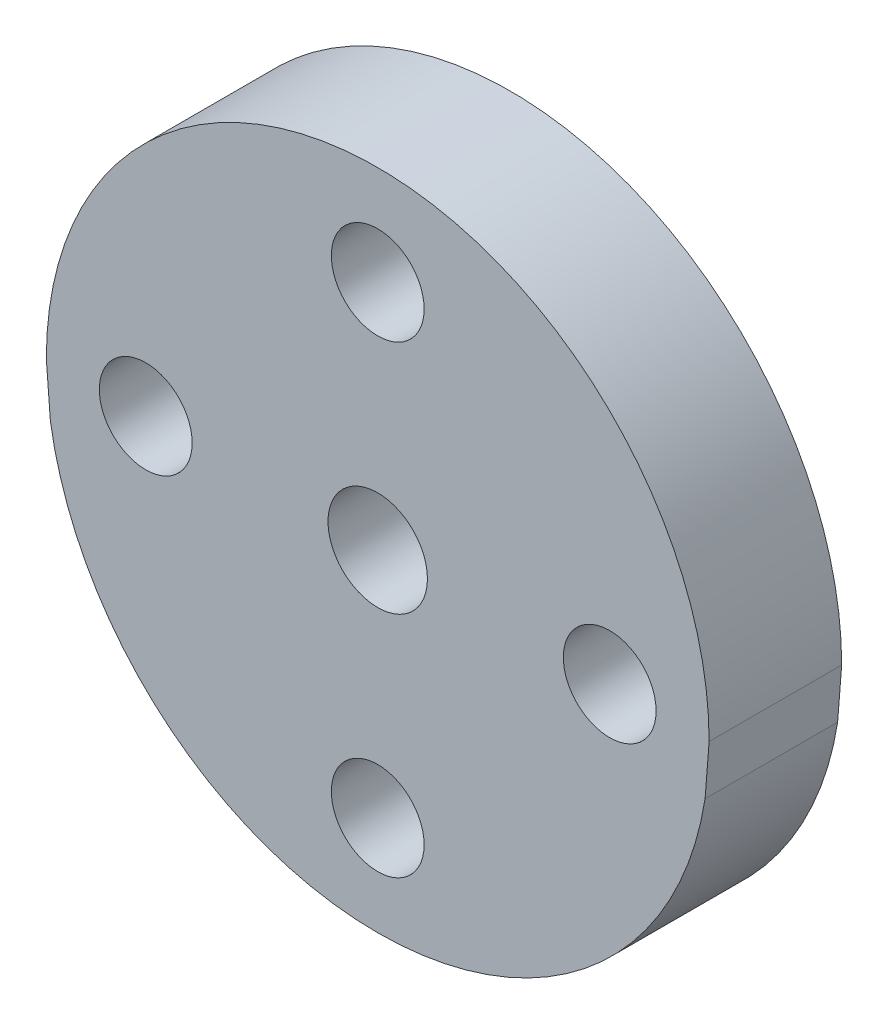
ISO-10303-21;
HEADER;
FILE_DESCRIPTION(('STEP AP214'),'2;1');
FILE_NAME('part.step','',(''),(''),'','','');
FILE_SCHEMA(('AUTOMOTIVE_DESIGN { 1 0 10303 214 1 1 1 1 }'));
ENDSEC;
DATA;
#1=APPLICATION_CONTEXT('core data for automotive mechanical design processes');
#2=APPLICATION_PROTOCOL_DEFINITION('international standard','automotive_design',2000,#1);
#3=PRODUCT_CONTEXT('',#1,'mechanical');
#4=PRODUCT('Part','Part','',(#3));
#5=PRODUCT_RELATED_PRODUCT_CATEGORY('part','',(#4));
#6=PRODUCT_DEFINITION_FORMATION('','',#4);
#7=PRODUCT_DEFINITION_CONTEXT('part definition',#1,'design');
#8=PRODUCT_DEFINITION('design','',#6,#7);
#9=PRODUCT_DEFINITION_SHAPE('','',#8);
#10=(LENGTH_UNIT() NAMED_UNIT(*) SI_UNIT(.MILLI.,.METRE.));
#11=(NAMED_UNIT(*) PLANE_ANGLE_UNIT() SI_UNIT($,.RADIAN.));
#12=(NAMED_UNIT(*) SI_UNIT($,.STERADIAN.) SOLID_ANGLE_UNIT());
#13=UNCERTAINTY_MEASURE_WITH_UNIT(LENGTH_MEASURE(1.E-05),#10,'distance_accuracy_value','');
#14=(GEOMETRIC_REPRESENTATION_CONTEXT(3) GLOBAL_UNCERTAINTY_ASSIGNED_CONTEXT((#13)) GLOBAL_UNIT_ASSIGNED_CONTEXT((#10,
#11,#12)) REPRESENTATION_CONTEXT('',''));
#15=CARTESIAN_POINT('',(0.,0.,0.));
#16=DIRECTION('',(0.,0.,1.));
#17=DIRECTION('',(1.,0.,0.));
#18=AXIS2_PLACEMENT_3D('',#15,#16,#17);
#19=CARTESIAN_POINT('',(0.,-30.,4.));
#20=DIRECTION('',(0.,0.,1.));
#21=DIRECTION('',(1.,0.,0.));
#22=AXIS2_PLACEMENT_3D('',#19,#20,#21);
#23=PLANE('',#22);
#24=CARTESIAN_POINT('',(7.,0.,4.));
#25=DIRECTION('',(0.,0.,1.));
#26=DIRECTION('',(1.,0.,0.));
#27=AXIS2_PLACEMENT_3D('',#24,#25,#26);
#28=CIRCLE('',#27,1.4);
#29=CARTESIAN_POINT('',(8.4,0.,4.));
#30=VERTEX_POINT('',#29);
#31=EDGE_CURVE('E222',#30,#30,#28,.T.);
#32=ORIENTED_EDGE('',*,*,#31,.F.);
#33=EDGE_LOOP('',(#32));
#34=FACE_BOUND('',#33,.T.);
#35=CARTESIAN_POINT('',(0.,7.,4.));
#36=DIRECTION('',(0.,0.,1.));
#37=DIRECTION('',(1.,0.,0.));
#38=AXIS2_PLACEMENT_3D('',#35,#36,#37);
#39=CIRCLE('',#38,1.4);
#40=CARTESIAN_POINT('',(1.4,7.,4.));
#41=VERTEX_POINT('',#40);
#42=EDGE_CURVE('E208',#41,#41,#39,.T.);
#43=ORIENTED_EDGE('',*,*,#42,.F.);
#44=EDGE_LOOP('',(#43));
#45=FACE_BOUND('',#44,.T.);
#46=CARTESIAN_POINT('',(-7.,0.,4.));
#47=DIRECTION('',(0.,0.,1.));
#48=DIRECTION('',(1.,0.,0.));
#49=AXIS2_PLACEMENT_3D('',#46,#47,#48);
#50=CIRCLE('',#49,1.4);
#51=CARTESIAN_POINT('',(-5.6,0.,4.));
#52=VERTEX_POINT('',#51);
#53=EDGE_CURVE('E186',#52,#52,#50,.T.);
#54=ORIENTED_EDGE('',*,*,#53,.F.);
#55=EDGE_LOOP('',(#54));
#56=FACE_BOUND('',#55,.T.);
#57=CARTESIAN_POINT('',(0.,0.,4.));
#58=DIRECTION('',(0.,0.,1.));
#59=DIRECTION('',(1.,0.,0.));
#60=AXIS2_PLACEMENT_3D('',#57,#58,#59);
#61=CIRCLE('',#60,1.5);
#62=CARTESIAN_POINT('',(1.5,0.,4.));
#63=VERTEX_POINT('',#62);
#64=EDGE_CURVE('E214',#63,#63,#61,.T.);
#65=ORIENTED_EDGE('',*,*,#64,.F.);
#66=EDGE_LOOP('',(#65));
#67=FACE_BOUND('',#66,.T.);
#68=CARTESIAN_POINT('',(0.,-7.,4.));
#69=DIRECTION('',(0.,0.,1.));
#70=DIRECTION('',(1.,0.,0.));
#71=AXIS2_PLACEMENT_3D('',#68,#69,#70);
#72=CIRCLE('',#71,1.4);
#73=CARTESIAN_POINT('',(1.4,-7.,4.));
#74=VERTEX_POINT('',#73);
#75=EDGE_CURVE('E230',#74,#74,#72,.T.);
#76=ORIENTED_EDGE('',*,*,#75,.F.);
#77=EDGE_LOOP('',(#76));
#78=FACE_BOUND('',#77,.T.);
#79=DIRECTION('',(0.0779982555262888,-0.99695349547251,0.));
#80=VECTOR('',#79,1.);
#81=CARTESIAN_POINT('',(-10.,0.,4.));
#82=LINE('',#81,#80);
#83=CARTESIAN_POINT('',(-10.,0.,4.));
#84=VERTEX_POINT('',#83);
#85=CARTESIAN_POINT('',(-9.87832544269712,-1.55521266975379,4.));
#86=VERTEX_POINT('',#85);
#87=EDGE_CURVE('E175',#84,#86,#82,.T.);
#88=ORIENTED_EDGE('',*,*,#87,.T.);
#89=CARTESIAN_POINT('',(0.,0.,4.));
#90=DIRECTION('',(0.,0.,1.));
#91=DIRECTION('',(1.,0.,0.));
#92=AXIS2_PLACEMENT_3D('',#89,#90,#91);
#93=CIRCLE('',#92,10.);
#94=CARTESIAN_POINT('',(9.87832544269712,-1.55521266975379,4.));
#95=VERTEX_POINT('',#94);
#96=EDGE_CURVE('E246',#86,#95,#93,.T.);
#97=ORIENTED_EDGE('',*,*,#96,.T.);
#98=DIRECTION('',(-0.0779982555262888,-0.99695349547251,0.));
#99=VECTOR('',#98,1.);
#100=CARTESIAN_POINT('',(10.,0.,4.));
#101=LINE('',#100,#99);
#102=CARTESIAN_POINT('',(10.,0.,4.));
#103=VERTEX_POINT('',#102);
#104=EDGE_CURVE('E199',#103,#95,#101,.T.);
#105=ORIENTED_EDGE('',*,*,#104,.F.);
#106=CARTESIAN_POINT('',(0.,0.,4.));
#107=DIRECTION('',(0.,0.,1.));
#108=DIRECTION('',(1.,0.,0.));
#109=AXIS2_PLACEMENT_3D('',#106,#107,#108);
#110=CIRCLE('',#109,10.);
#111=EDGE_CURVE('E152',#103,#84,#110,.T.);
#112=ORIENTED_EDGE('',*,*,#111,.T.);
#113=EDGE_LOOP('',(#88,#97,#105,#112));
#114=FACE_BOUND('',#113,.T.);
#115=ADVANCED_FACE('F128',(#34,#45,#56,#67,#78,#114),#23,.T.);
#116=CARTESIAN_POINT('',(0.,-30.,0.));
#117=DIRECTION('',(0.,0.,1.));
#118=DIRECTION('',(1.,0.,0.));
#119=AXIS2_PLACEMENT_3D('',#116,#117,#118);
#120=PLANE('',#119);
#121=CARTESIAN_POINT('',(0.,-7.,0.));
#122=DIRECTION('',(0.,0.,1.));
#123=DIRECTION('',(1.,0.,0.));
#124=AXIS2_PLACEMENT_3D('',#121,#122,#123);
#125=CIRCLE('',#124,1.4);
#126=CARTESIAN_POINT('',(1.4,-7.,0.));
#127=VERTEX_POINT('',#126);
#128=EDGE_CURVE('E234',#127,#127,#125,.T.);
#129=ORIENTED_EDGE('',*,*,#128,.T.);
#130=EDGE_LOOP('',(#129));
#131=FACE_BOUND('',#130,.T.);
#132=CARTESIAN_POINT('',(7.,0.,0.));
#133=DIRECTION('',(0.,0.,1.));
#134=DIRECTION('',(1.,0.,0.));
#135=AXIS2_PLACEMENT_3D('',#132,#133,#134);
#136=CIRCLE('',#135,1.4);
#137=CARTESIAN_POINT('',(8.4,0.,0.));
#138=VERTEX_POINT('',#137);
#139=EDGE_CURVE('E226',#138,#138,#136,.T.);
#140=ORIENTED_EDGE('',*,*,#139,.T.);
#141=EDGE_LOOP('',(#140));
#142=FACE_BOUND('',#141,.T.);
#143=CARTESIAN_POINT('',(0.,0.,0.));
#144=DIRECTION('',(0.,0.,1.));
#145=DIRECTION('',(1.,0.,0.));
#146=AXIS2_PLACEMENT_3D('',#143,#144,#145);
#147=CIRCLE('',#146,1.5);
#148=CARTESIAN_POINT('',(1.5,0.,0.));
#149=VERTEX_POINT('',#148);
#150=EDGE_CURVE('E218',#149,#149,#147,.T.);
#151=ORIENTED_EDGE('',*,*,#150,.T.);
#152=EDGE_LOOP('',(#151));
#153=FACE_BOUND('',#152,.T.);
#154=CARTESIAN_POINT('',(0.,7.,0.));
#155=DIRECTION('',(0.,0.,1.));
#156=DIRECTION('',(1.,0.,0.));
#157=AXIS2_PLACEMENT_3D('',#154,#155,#156);
#158=CIRCLE('',#157,1.4);
#159=CARTESIAN_POINT('',(1.4,7.,0.));
#160=VERTEX_POINT('',#159);
#161=EDGE_CURVE('E210',#160,#160,#158,.T.);
#162=ORIENTED_EDGE('',*,*,#161,.T.);
#163=EDGE_LOOP('',(#162));
#164=FACE_BOUND('',#163,.T.);
#165=CARTESIAN_POINT('',(-7.,0.,0.));
#166=DIRECTION('',(0.,0.,1.));
#167=DIRECTION('',(1.,0.,0.));
#168=AXIS2_PLACEMENT_3D('',#165,#166,#167);
#169=CIRCLE('',#168,1.4);
#170=CARTESIAN_POINT('',(-5.6,0.,0.));
#171=VERTEX_POINT('',#170);
#172=EDGE_CURVE('E192',#171,#171,#169,.T.);
#173=ORIENTED_EDGE('',*,*,#172,.T.);
#174=EDGE_LOOP('',(#173));
#175=FACE_BOUND('',#174,.T.);
#176=CARTESIAN_POINT('',(0.,0.,0.));
#177=DIRECTION('',(0.,0.,1.));
#178=DIRECTION('',(1.,0.,0.));
#179=AXIS2_PLACEMENT_3D('',#176,#177,#178);
#180=CIRCLE('',#179,10.);
#181=CARTESIAN_POINT('',(-9.87832544269712,-1.55521266975379,0.));
#182=VERTEX_POINT('',#181);
#183=CARTESIAN_POINT('',(9.87832544269711,-1.55521266975382,0.));
#184=VERTEX_POINT('',#183);
#185=EDGE_CURVE('E144',#182,#184,#180,.T.);
#186=ORIENTED_EDGE('',*,*,#185,.F.);
#187=DIRECTION('',(0.0779982555262888,-0.99695349547251,0.));
#188=VECTOR('',#187,1.);
#189=CARTESIAN_POINT('',(-10.,0.,0.));
#190=LINE('',#189,#188);
#191=CARTESIAN_POINT('',(-10.,0.,0.));
#192=VERTEX_POINT('',#191);
#193=EDGE_CURVE('E181',#192,#182,#190,.T.);
#194=ORIENTED_EDGE('',*,*,#193,.F.);
#195=CARTESIAN_POINT('',(0.,0.,0.));
#196=DIRECTION('',(0.,0.,1.));
#197=DIRECTION('',(1.,0.,0.));
#198=AXIS2_PLACEMENT_3D('',#195,#196,#197);
#199=CIRCLE('',#198,10.);
#200=CARTESIAN_POINT('',(10.,0.,0.));
#201=VERTEX_POINT('',#200);
#202=EDGE_CURVE('E165',#201,#192,#199,.T.);
#203=ORIENTED_EDGE('',*,*,#202,.F.);
#204=DIRECTION('',(-0.0779982555262888,-0.99695349547251,0.));
#205=VECTOR('',#204,1.);
#206=CARTESIAN_POINT('',(10.,0.,0.));
#207=LINE('',#206,#205);
#208=EDGE_CURVE('E176',#201,#184,#207,.T.);
#209=ORIENTED_EDGE('',*,*,#208,.T.);
#210=EDGE_LOOP('',(#186,#194,#203,#209));
#211=FACE_BOUND('',#210,.T.);
#212=ADVANCED_FACE('F184',(#131,#142,#153,#164,#175,#211),#120,.F.);
#213=CARTESIAN_POINT('',(-10.,0.,4.));
#214=DIRECTION('',(0.99695349547251,0.0779982555262888,0.));
#215=DIRECTION('',(-0.0779982555262888,0.99695349547251,0.));
#216=AXIS2_PLACEMENT_3D('',#213,#214,#215);
#217=PLANE('',#216);
#218=DIRECTION('',(0.,0.,1.));
#219=VECTOR('',#218,1.);
#220=CARTESIAN_POINT('',(-9.87832544269712,-1.55521266975379,-6.));
#221=LINE('',#220,#219);
#222=EDGE_CURVE('E243',#182,#86,#221,.T.);
#223=ORIENTED_EDGE('',*,*,#222,.T.);
#224=ORIENTED_EDGE('',*,*,#87,.F.);
#225=DIRECTION('',(0.,0.,-1.));
#226=VECTOR('',#225,1.);
#227=CARTESIAN_POINT('',(-10.,0.,4.));
#228=LINE('',#227,#226);
#229=EDGE_CURVE('E168',#84,#192,#228,.T.);
#230=ORIENTED_EDGE('',*,*,#229,.T.);
#231=ORIENTED_EDGE('',*,*,#193,.T.);
#232=EDGE_LOOP('',(#223,#224,#230,#231));
#233=FACE_BOUND('',#232,.T.);
#234=ADVANCED_FACE('F130',(#233),#217,.F.);
#235=CARTESIAN_POINT('',(10.,0.,4.));
#236=DIRECTION('',(0.99695349547251,-0.0779982555262888,0.));
#237=DIRECTION('',(0.0779982555262888,0.99695349547251,0.));
#238=AXIS2_PLACEMENT_3D('',#235,#236,#237);
#239=PLANE('',#238);
#240=ORIENTED_EDGE('',*,*,#104,.T.);
#241=DIRECTION('',(0.,0.,1.));
#242=VECTOR('',#241,1.);
#243=CARTESIAN_POINT('',(9.87832544269711,-1.55521266975382,-6.));
#244=LINE('',#243,#242);
#245=EDGE_CURVE('E12',#95,#184,#244,.F.);
#246=ORIENTED_EDGE('',*,*,#245,.T.);
#247=ORIENTED_EDGE('',*,*,#208,.F.);
#248=DIRECTION('',(0.,0.,-1.));
#249=VECTOR('',#248,1.);
#250=CARTESIAN_POINT('',(10.,0.,4.));
#251=LINE('',#250,#249);
#252=EDGE_CURVE('E137',#103,#201,#251,.T.);
#253=ORIENTED_EDGE('',*,*,#252,.F.);
#254=EDGE_LOOP('',(#240,#246,#247,#253));
#255=FACE_BOUND('',#254,.T.);
#256=ADVANCED_FACE('F252',(#255),#239,.T.);
#257=CARTESIAN_POINT('',(0.,0.,4.));
#258=DIRECTION('',(0.,0.,-1.));
#259=DIRECTION('',(-1.,0.,0.));
#260=AXIS2_PLACEMENT_3D('',#257,#258,#259);
#261=CYLINDRICAL_SURFACE('',#260,10.);
#262=ORIENTED_EDGE('',*,*,#202,.T.);
#263=ORIENTED_EDGE('',*,*,#229,.F.);
#264=ORIENTED_EDGE('',*,*,#111,.F.);
#265=ORIENTED_EDGE('',*,*,#252,.T.);
#266=EDGE_LOOP('',(#262,#263,#264,#265));
#267=FACE_BOUND('',#266,.T.);
#268=ADVANCED_FACE('F167',(#267),#261,.T.);
#269=CARTESIAN_POINT('',(-7.,0.,4.));
#270=DIRECTION('',(0.,0.,-1.));
#271=DIRECTION('',(-1.,0.,0.));
#272=AXIS2_PLACEMENT_3D('',#269,#270,#271);
#273=CYLINDRICAL_SURFACE('',#272,1.4);
#274=ORIENTED_EDGE('',*,*,#53,.T.);
#275=EDGE_LOOP('',(#274));
#276=FACE_BOUND('',#275,.T.);
#277=ORIENTED_EDGE('',*,*,#172,.F.);
#278=EDGE_LOOP('',(#277));
#279=FACE_BOUND('',#278,.T.);
#280=ADVANCED_FACE('F276',(#276,#279),#273,.F.);
#281=CARTESIAN_POINT('',(0.,7.,4.));
#282=DIRECTION('',(0.,0.,-1.));
#283=DIRECTION('',(-1.,0.,0.));
#284=AXIS2_PLACEMENT_3D('',#281,#282,#283);
#285=CYLINDRICAL_SURFACE('',#284,1.4);
#286=ORIENTED_EDGE('',*,*,#42,.T.);
#287=EDGE_LOOP('',(#286));
#288=FACE_BOUND('',#287,.T.);
#289=ORIENTED_EDGE('',*,*,#161,.F.);
#290=EDGE_LOOP('',(#289));
#291=FACE_BOUND('',#290,.T.);
#292=ADVANCED_FACE('F345',(#288,#291),#285,.F.);
#293=CARTESIAN_POINT('',(0.,0.,4.));
#294=DIRECTION('',(0.,0.,-1.));
#295=DIRECTION('',(-1.,0.,0.));
#296=AXIS2_PLACEMENT_3D('',#293,#294,#295);
#297=CYLINDRICAL_SURFACE('',#296,1.5);
#298=ORIENTED_EDGE('',*,*,#64,.T.);
#299=EDGE_LOOP('',(#298));
#300=FACE_BOUND('',#299,.T.);
#301=ORIENTED_EDGE('',*,*,#150,.F.);
#302=EDGE_LOOP('',(#301));
#303=FACE_BOUND('',#302,.T.);
#304=ADVANCED_FACE('F337',(#300,#303),#297,.F.);
#305=CARTESIAN_POINT('',(7.,0.,4.));
#306=DIRECTION('',(0.,0.,-1.));
#307=DIRECTION('',(-1.,0.,0.));
#308=AXIS2_PLACEMENT_3D('',#305,#306,#307);
#309=CYLINDRICAL_SURFACE('',#308,1.4);
#310=ORIENTED_EDGE('',*,*,#31,.T.);
#311=EDGE_LOOP('',(#310));
#312=FACE_BOUND('',#311,.T.);
#313=ORIENTED_EDGE('',*,*,#139,.F.);
#314=EDGE_LOOP('',(#313));
#315=FACE_BOUND('',#314,.T.);
#316=ADVANCED_FACE('F261',(#312,#315),#309,.F.);
#317=CARTESIAN_POINT('',(0.,-7.,4.));
#318=DIRECTION('',(0.,0.,-1.));
#319=DIRECTION('',(-1.,0.,0.));
#320=AXIS2_PLACEMENT_3D('',#317,#318,#319);
#321=CYLINDRICAL_SURFACE('',#320,1.4);
#322=ORIENTED_EDGE('',*,*,#75,.T.);
#323=EDGE_LOOP('',(#322));
#324=FACE_BOUND('',#323,.T.);
#325=ORIENTED_EDGE('',*,*,#128,.F.);
#326=EDGE_LOOP('',(#325));
#327=FACE_BOUND('',#326,.T.);
#328=ADVANCED_FACE('F255',(#324,#327),#321,.F.);
#329=CARTESIAN_POINT('',(0.,0.,-6.));
#330=DIRECTION('',(0.,0.,1.));
#331=DIRECTION('',(1.,0.,0.));
#332=AXIS2_PLACEMENT_3D('',#329,#330,#331);
#333=CYLINDRICAL_SURFACE('',#332,10.);
#334=ORIENTED_EDGE('',*,*,#185,.T.);
#335=ORIENTED_EDGE('',*,*,#245,.F.);
#336=ORIENTED_EDGE('',*,*,#96,.F.);
#337=ORIENTED_EDGE('',*,*,#222,.F.);
#338=EDGE_LOOP('',(#334,#335,#336,#337));
#339=FACE_BOUND('',#338,.T.);
#340=ADVANCED_FACE('F253',(#339),#333,.T.);
#341=CLOSED_SHELL('',(#115,#212,#234,#256,#268,#280,#292,#304,#316,#328,#340));
#342=MANIFOLD_SOLID_BREP('B2',#341);
#343=ADVANCED_BREP_SHAPE_REPRESENTATION('',(#18,#342),#14);
#344=SHAPE_DEFINITION_REPRESENTATION(#9,#343);
ENDSEC;
END-ISO-10303-21;
